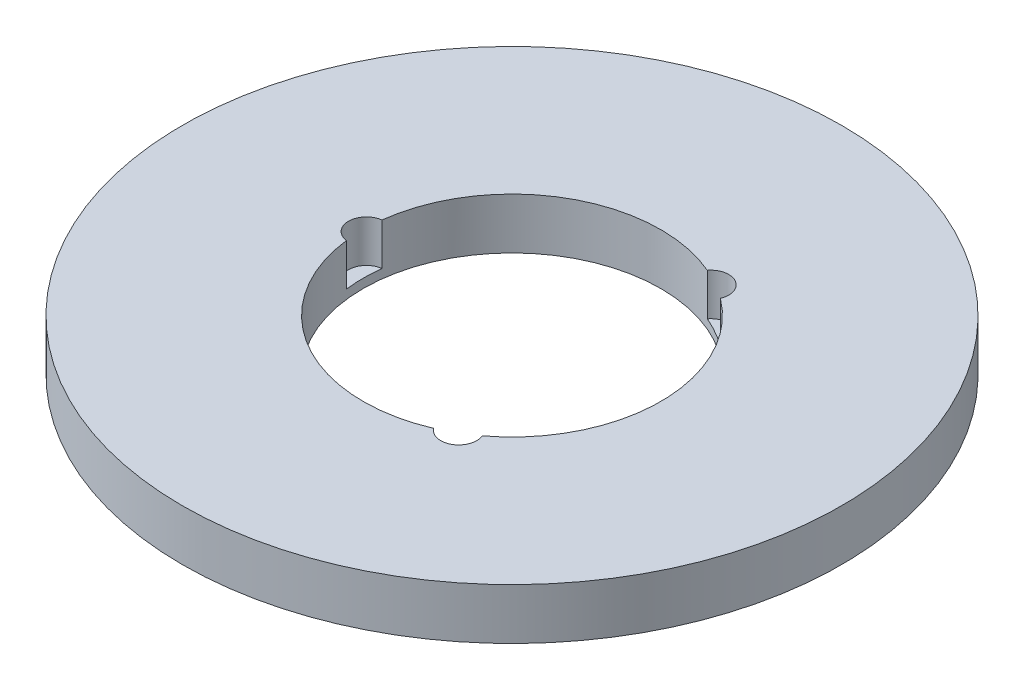
ISO-10303-21;
HEADER;
FILE_DESCRIPTION(('STEP AP214'),'2;1');
FILE_NAME('part.step','',(''),(''),'','','');
FILE_SCHEMA(('AUTOMOTIVE_DESIGN { 1 0 10303 214 1 1 1 1 }'));
ENDSEC;
DATA;
#1=APPLICATION_CONTEXT('core data for automotive mechanical design processes');
#2=APPLICATION_PROTOCOL_DEFINITION('international standard','automotive_design',2000,#1);
#3=PRODUCT_CONTEXT('',#1,'mechanical');
#4=PRODUCT('Part','Part','',(#3));
#5=PRODUCT_RELATED_PRODUCT_CATEGORY('part','',(#4));
#6=PRODUCT_DEFINITION_FORMATION('','',#4);
#7=PRODUCT_DEFINITION_CONTEXT('part definition',#1,'design');
#8=PRODUCT_DEFINITION('design','',#6,#7);
#9=PRODUCT_DEFINITION_SHAPE('','',#8);
#10=(LENGTH_UNIT() NAMED_UNIT(*) SI_UNIT(.MILLI.,.METRE.));
#11=(NAMED_UNIT(*) PLANE_ANGLE_UNIT() SI_UNIT($,.RADIAN.));
#12=(NAMED_UNIT(*) SI_UNIT($,.STERADIAN.) SOLID_ANGLE_UNIT());
#13=UNCERTAINTY_MEASURE_WITH_UNIT(LENGTH_MEASURE(1.E-05),#10,'distance_accuracy_value','');
#14=(GEOMETRIC_REPRESENTATION_CONTEXT(3) GLOBAL_UNCERTAINTY_ASSIGNED_CONTEXT((#13)) GLOBAL_UNIT_ASSIGNED_CONTEXT((#10,
#11,#12)) REPRESENTATION_CONTEXT('',''));
#15=CARTESIAN_POINT('',(0.,0.,0.));
#16=DIRECTION('',(0.,0.,1.));
#17=DIRECTION('',(1.,0.,0.));
#18=AXIS2_PLACEMENT_3D('',#15,#16,#17);
#19=CARTESIAN_POINT('',(0.,12.,0.));
#20=DIRECTION('',(0.,-1.,0.));
#21=DIRECTION('',(0.,0.,-1.));
#22=AXIS2_PLACEMENT_3D('',#19,#20,#21);
#23=CYLINDRICAL_SURFACE('',#22,77.5);
#24=CARTESIAN_POINT('',(0.,12.,0.));
#25=DIRECTION('',(0.,1.,0.));
#26=DIRECTION('',(0.,0.,1.));
#27=AXIS2_PLACEMENT_3D('',#24,#25,#26);
#28=CIRCLE('',#27,77.5);
#29=CARTESIAN_POINT('',(0.,12.,77.5));
#30=VERTEX_POINT('',#29);
#31=EDGE_CURVE('E130',#30,#30,#28,.T.);
#32=ORIENTED_EDGE('',*,*,#31,.F.);
#33=EDGE_LOOP('',(#32));
#34=FACE_BOUND('',#33,.T.);
#35=CARTESIAN_POINT('',(0.,0.,0.));
#36=DIRECTION('',(0.,1.,0.));
#37=DIRECTION('',(0.,0.,1.));
#38=AXIS2_PLACEMENT_3D('',#35,#36,#37);
#39=CIRCLE('',#38,77.5);
#40=CARTESIAN_POINT('',(0.,0.,77.5));
#41=VERTEX_POINT('',#40);
#42=EDGE_CURVE('E117',#41,#41,#39,.T.);
#43=ORIENTED_EDGE('',*,*,#42,.T.);
#44=EDGE_LOOP('',(#43));
#45=FACE_BOUND('',#44,.T.);
#46=ADVANCED_FACE('F39',(#34,#45),#23,.T.);
#47=CARTESIAN_POINT('',(0.,12.,0.));
#48=DIRECTION('',(0.,1.,0.));
#49=DIRECTION('',(0.,0.,1.));
#50=AXIS2_PLACEMENT_3D('',#47,#48,#49);
#51=PLANE('',#50);
#52=CARTESIAN_POINT('',(17.112665377115,12.,29.6400058860877));
#53=DIRECTION('',(0.,1.,0.));
#54=DIRECTION('',(0.866025403784436,0.,-0.500000000000004));
#55=AXIS2_PLACEMENT_3D('',#52,#53,#54);
#56=CIRCLE('',#55,4.21596169485795);
#57=CARTESIAN_POINT('',(13.7517063867195,12.,32.1852539442127));
#58=VERTEX_POINT('',#57);
#59=CARTESIAN_POINT('',(20.997394349582,12.,28.0019540483899));
#60=VERTEX_POINT('',#59);
#61=EDGE_CURVE('E148',#58,#60,#56,.T.);
#62=ORIENTED_EDGE('',*,*,#61,.F.);
#63=CARTESIAN_POINT('',(0.,12.,0.));
#64=DIRECTION('',(0.,1.,0.));
#65=DIRECTION('',(0.,0.,1.));
#66=AXIS2_PLACEMENT_3D('',#63,#64,#65);
#67=CIRCLE('',#66,35.);
#68=CARTESIAN_POINT('',(-34.7491007363012,12.,4.18329989582272));
#69=VERTEX_POINT('',#68);
#70=EDGE_CURVE('E113',#69,#58,#67,.T.);
#71=ORIENTED_EDGE('',*,*,#70,.F.);
#72=CARTESIAN_POINT('',(-34.2253307542298,12.,0.));
#73=DIRECTION('',(0.,1.,0.));
#74=DIRECTION('',(0.,0.,1.));
#75=AXIS2_PLACEMENT_3D('',#72,#73,#74);
#76=CIRCLE('',#75,4.21596169485795);
#77=CARTESIAN_POINT('',(-34.7491007363012,12.,-4.18329989582272));
#78=VERTEX_POINT('',#77);
#79=EDGE_CURVE('E125',#78,#69,#76,.T.);
#80=ORIENTED_EDGE('',*,*,#79,.F.);
#81=CARTESIAN_POINT('',(13.751706386719,12.,-32.1852539442129));
#82=VERTEX_POINT('',#81);
#83=EDGE_CURVE('E107',#82,#78,#67,.T.);
#84=ORIENTED_EDGE('',*,*,#83,.F.);
#85=CARTESIAN_POINT('',(17.1126653771146,12.,-29.640005886088));
#86=DIRECTION('',(0.,1.,0.));
#87=DIRECTION('',(-0.866025403784443,0.,-0.499999999999992));
#88=AXIS2_PLACEMENT_3D('',#85,#86,#87);
#89=CIRCLE('',#88,4.21596169485795);
#90=CARTESIAN_POINT('',(20.9973943495816,12.,-28.0019540483902));
#91=VERTEX_POINT('',#90);
#92=EDGE_CURVE('E95',#91,#82,#89,.T.);
#93=ORIENTED_EDGE('',*,*,#92,.F.);
#94=EDGE_CURVE('E106',#60,#91,#67,.T.);
#95=ORIENTED_EDGE('',*,*,#94,.F.);
#96=EDGE_LOOP('',(#62,#71,#80,#84,#93,#95));
#97=FACE_BOUND('',#96,.T.);
#98=ORIENTED_EDGE('',*,*,#31,.T.);
#99=EDGE_LOOP('',(#98));
#100=FACE_BOUND('',#99,.T.);
#101=ADVANCED_FACE('F102',(#97,#100),#51,.T.);
#102=CARTESIAN_POINT('',(0.,0.,0.));
#103=DIRECTION('',(0.,1.,0.));
#104=DIRECTION('',(0.,0.,1.));
#105=AXIS2_PLACEMENT_3D('',#102,#103,#104);
#106=PLANE('',#105);
#107=CARTESIAN_POINT('',(0.,0.,0.));
#108=DIRECTION('',(0.,1.,0.));
#109=DIRECTION('',(0.,0.,1.));
#110=AXIS2_PLACEMENT_3D('',#107,#108,#109);
#111=CIRCLE('',#110,35.);
#112=CARTESIAN_POINT('',(0.,0.,35.));
#113=VERTEX_POINT('',#112);
#114=EDGE_CURVE('E118',#113,#113,#111,.T.);
#115=ORIENTED_EDGE('',*,*,#114,.T.);
#116=EDGE_LOOP('',(#115));
#117=FACE_BOUND('',#116,.T.);
#118=ORIENTED_EDGE('',*,*,#42,.F.);
#119=EDGE_LOOP('',(#118));
#120=FACE_BOUND('',#119,.T.);
#121=ADVANCED_FACE('F161',(#117,#120),#106,.F.);
#122=CARTESIAN_POINT('',(0.,12.,0.));
#123=DIRECTION('',(0.,-1.,0.));
#124=DIRECTION('',(0.,0.,-1.));
#125=AXIS2_PLACEMENT_3D('',#122,#123,#124);
#126=CYLINDRICAL_SURFACE('',#125,35.);
#127=DIRECTION('',(0.,1.,0.));
#128=VECTOR('',#127,1.);
#129=CARTESIAN_POINT('',(13.7517063867195,7.0566139041421,32.1852539442127));
#130=LINE('',#129,#128);
#131=CARTESIAN_POINT('',(13.7517063867195,2.1132278082842,32.1852539442127));
#132=VERTEX_POINT('',#131);
#133=EDGE_CURVE('E11',#132,#58,#130,.T.);
#134=ORIENTED_EDGE('',*,*,#133,.F.);
#135=CARTESIAN_POINT('',(0.,2.1132278082842,0.));
#136=DIRECTION('',(0.,1.,0.));
#137=DIRECTION('',(0.,0.,1.));
#138=AXIS2_PLACEMENT_3D('',#135,#136,#137);
#139=CIRCLE('',#138,35.);
#140=CARTESIAN_POINT('',(20.997394349582,2.1132278082842,28.0019540483899));
#141=VERTEX_POINT('',#140);
#142=EDGE_CURVE('E100',#132,#141,#139,.T.);
#143=ORIENTED_EDGE('',*,*,#142,.T.);
#144=DIRECTION('',(0.,1.,0.));
#145=VECTOR('',#144,1.);
#146=CARTESIAN_POINT('',(20.997394349582,7.0566139041421,28.0019540483899));
#147=LINE('',#146,#145);
#148=EDGE_CURVE('E46',#60,#141,#147,.F.);
#149=ORIENTED_EDGE('',*,*,#148,.F.);
#150=ORIENTED_EDGE('',*,*,#94,.T.);
#151=DIRECTION('',(0.,1.,0.));
#152=VECTOR('',#151,1.);
#153=CARTESIAN_POINT('',(20.9973943495816,7.0566139041421,-28.0019540483902));
#154=LINE('',#153,#152);
#155=CARTESIAN_POINT('',(20.9973943495816,2.1132278082842,-28.0019540483902));
#156=VERTEX_POINT('',#155);
#157=EDGE_CURVE('E90',#156,#91,#154,.T.);
#158=ORIENTED_EDGE('',*,*,#157,.F.);
#159=CARTESIAN_POINT('',(0.,2.1132278082842,0.));
#160=DIRECTION('',(0.,1.,0.));
#161=DIRECTION('',(0.,0.,1.));
#162=AXIS2_PLACEMENT_3D('',#159,#160,#161);
#163=CIRCLE('',#162,35.);
#164=CARTESIAN_POINT('',(13.751706386719,2.1132278082842,-32.1852539442129));
#165=VERTEX_POINT('',#164);
#166=EDGE_CURVE('E143',#156,#165,#163,.T.);
#167=ORIENTED_EDGE('',*,*,#166,.T.);
#168=DIRECTION('',(0.,1.,0.));
#169=VECTOR('',#168,1.);
#170=CARTESIAN_POINT('',(13.751706386719,7.0566139041421,-32.1852539442129));
#171=LINE('',#170,#169);
#172=EDGE_CURVE('E98',#82,#165,#171,.F.);
#173=ORIENTED_EDGE('',*,*,#172,.F.);
#174=ORIENTED_EDGE('',*,*,#83,.T.);
#175=DIRECTION('',(0.,1.,0.));
#176=VECTOR('',#175,1.);
#177=CARTESIAN_POINT('',(-34.7491007363012,7.0566139041421,-4.18329989582272));
#178=LINE('',#177,#176);
#179=CARTESIAN_POINT('',(-34.7491007363012,2.1132278082842,-4.18329989582272));
#180=VERTEX_POINT('',#179);
#181=EDGE_CURVE('E137',#180,#78,#178,.T.);
#182=ORIENTED_EDGE('',*,*,#181,.F.);
#183=CARTESIAN_POINT('',(0.,2.1132278082842,0.));
#184=DIRECTION('',(0.,1.,0.));
#185=DIRECTION('',(0.,0.,1.));
#186=AXIS2_PLACEMENT_3D('',#183,#184,#185);
#187=CIRCLE('',#186,35.);
#188=CARTESIAN_POINT('',(-34.7491007363012,2.1132278082842,4.18329989582272));
#189=VERTEX_POINT('',#188);
#190=EDGE_CURVE('E128',#180,#189,#187,.T.);
#191=ORIENTED_EDGE('',*,*,#190,.T.);
#192=DIRECTION('',(0.,1.,0.));
#193=VECTOR('',#192,1.);
#194=CARTESIAN_POINT('',(-34.7491007363012,7.0566139041421,4.18329989582272));
#195=LINE('',#194,#193);
#196=EDGE_CURVE('E134',#69,#189,#195,.F.);
#197=ORIENTED_EDGE('',*,*,#196,.F.);
#198=ORIENTED_EDGE('',*,*,#70,.T.);
#199=EDGE_LOOP('',(#134,#143,#149,#150,#158,#167,#173,#174,#182,#191,#197,#198));
#200=FACE_BOUND('',#199,.T.);
#201=ORIENTED_EDGE('',*,*,#114,.F.);
#202=EDGE_LOOP('',(#201));
#203=FACE_BOUND('',#202,.T.);
#204=ADVANCED_FACE('F115',(#200,#203),#126,.F.);
#205=CARTESIAN_POINT('',(-34.2253307542298,2.1132278082842,0.));
#206=DIRECTION('',(0.,1.,0.));
#207=DIRECTION('',(0.,0.,1.));
#208=AXIS2_PLACEMENT_3D('',#205,#206,#207);
#209=CYLINDRICAL_SURFACE('',#208,4.21596169485795);
#210=ORIENTED_EDGE('',*,*,#181,.T.);
#211=ORIENTED_EDGE('',*,*,#79,.T.);
#212=ORIENTED_EDGE('',*,*,#196,.T.);
#213=CARTESIAN_POINT('',(-34.2253307542298,2.1132278082842,0.));
#214=DIRECTION('',(0.,1.,0.));
#215=DIRECTION('',(0.,0.,1.));
#216=AXIS2_PLACEMENT_3D('',#213,#214,#215);
#217=CIRCLE('',#216,4.21596169485795);
#218=EDGE_CURVE('E127',#180,#189,#217,.T.);
#219=ORIENTED_EDGE('',*,*,#218,.F.);
#220=EDGE_LOOP('',(#210,#211,#212,#219));
#221=FACE_BOUND('',#220,.T.);
#222=ADVANCED_FACE('F175',(#221),#209,.F.);
#223=CARTESIAN_POINT('',(-34.2253307542298,2.1132278082842,0.));
#224=DIRECTION('',(0.,1.,0.));
#225=DIRECTION('',(0.,0.,1.));
#226=AXIS2_PLACEMENT_3D('',#223,#224,#225);
#227=PLANE('',#226);
#228=ORIENTED_EDGE('',*,*,#218,.T.);
#229=ORIENTED_EDGE('',*,*,#190,.F.);
#230=EDGE_LOOP('',(#228,#229));
#231=FACE_BOUND('',#230,.T.);
#232=ADVANCED_FACE('F176',(#231),#227,.T.);
#233=CARTESIAN_POINT('',(17.1126653771146,2.1132278082842,-29.640005886088));
#234=DIRECTION('',(0.,1.,0.));
#235=DIRECTION('',(0.,0.,1.));
#236=AXIS2_PLACEMENT_3D('',#233,#234,#235);
#237=CYLINDRICAL_SURFACE('',#236,4.21596169485795);
#238=ORIENTED_EDGE('',*,*,#157,.T.);
#239=ORIENTED_EDGE('',*,*,#92,.T.);
#240=ORIENTED_EDGE('',*,*,#172,.T.);
#241=CARTESIAN_POINT('',(17.1126653771146,2.1132278082842,-29.640005886088));
#242=DIRECTION('',(0.,1.,0.));
#243=DIRECTION('',(-0.866025403784443,0.,-0.499999999999992));
#244=AXIS2_PLACEMENT_3D('',#241,#242,#243);
#245=CIRCLE('',#244,4.21596169485795);
#246=EDGE_CURVE('E56',#156,#165,#245,.T.);
#247=ORIENTED_EDGE('',*,*,#246,.F.);
#248=EDGE_LOOP('',(#238,#239,#240,#247));
#249=FACE_BOUND('',#248,.T.);
#250=ADVANCED_FACE('F93',(#249),#237,.F.);
#251=CARTESIAN_POINT('',(17.1126653771146,2.1132278082842,-29.640005886088));
#252=DIRECTION('',(0.,1.,0.));
#253=DIRECTION('',(-0.866025403784443,0.,-0.499999999999992));
#254=AXIS2_PLACEMENT_3D('',#251,#252,#253);
#255=PLANE('',#254);
#256=ORIENTED_EDGE('',*,*,#246,.T.);
#257=ORIENTED_EDGE('',*,*,#166,.F.);
#258=EDGE_LOOP('',(#256,#257));
#259=FACE_BOUND('',#258,.T.);
#260=ADVANCED_FACE('F153',(#259),#255,.T.);
#261=CARTESIAN_POINT('',(17.112665377115,2.1132278082842,29.6400058860877));
#262=DIRECTION('',(0.,1.,0.));
#263=DIRECTION('',(0.,0.,1.));
#264=AXIS2_PLACEMENT_3D('',#261,#262,#263);
#265=CYLINDRICAL_SURFACE('',#264,4.21596169485795);
#266=ORIENTED_EDGE('',*,*,#133,.T.);
#267=ORIENTED_EDGE('',*,*,#61,.T.);
#268=ORIENTED_EDGE('',*,*,#148,.T.);
#269=CARTESIAN_POINT('',(17.112665377115,2.1132278082842,29.6400058860877));
#270=DIRECTION('',(0.,1.,0.));
#271=DIRECTION('',(0.866025403784436,0.,-0.500000000000004));
#272=AXIS2_PLACEMENT_3D('',#269,#270,#271);
#273=CIRCLE('',#272,4.21596169485795);
#274=EDGE_CURVE('E55',#132,#141,#273,.T.);
#275=ORIENTED_EDGE('',*,*,#274,.F.);
#276=EDGE_LOOP('',(#266,#267,#268,#275));
#277=FACE_BOUND('',#276,.T.);
#278=ADVANCED_FACE('F144',(#277),#265,.F.);
#279=CARTESIAN_POINT('',(17.112665377115,2.1132278082842,29.6400058860877));
#280=DIRECTION('',(0.,1.,0.));
#281=DIRECTION('',(0.866025403784436,0.,-0.500000000000004));
#282=AXIS2_PLACEMENT_3D('',#279,#280,#281);
#283=PLANE('',#282);
#284=ORIENTED_EDGE('',*,*,#274,.T.);
#285=ORIENTED_EDGE('',*,*,#142,.F.);
#286=EDGE_LOOP('',(#284,#285));
#287=FACE_BOUND('',#286,.T.);
#288=ADVANCED_FACE('F150',(#287),#283,.T.);
#289=CLOSED_SHELL('',(#46,#101,#121,#204,#222,#232,#250,#260,#278,#288));
#290=MANIFOLD_SOLID_BREP('B2',#289);
#291=ADVANCED_BREP_SHAPE_REPRESENTATION('',(#18,#290),#14);
#292=SHAPE_DEFINITION_REPRESENTATION(#9,#291);
ENDSEC;
END-ISO-10303-21;
